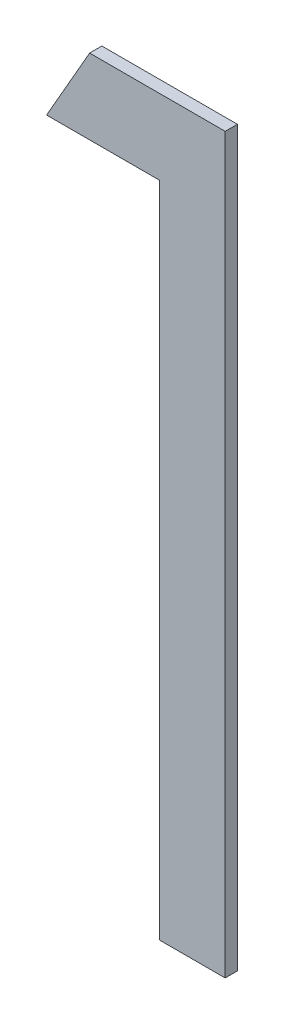
ISO-10303-21;
HEADER;
FILE_DESCRIPTION(('STEP AP214'),'2;1');
FILE_NAME('part.step','',(''),(''),'','','');
FILE_SCHEMA(('AUTOMOTIVE_DESIGN { 1 0 10303 214 1 1 1 1 }'));
ENDSEC;
DATA;
#1=APPLICATION_CONTEXT('core data for automotive mechanical design processes');
#2=APPLICATION_PROTOCOL_DEFINITION('international standard','automotive_design',2000,#1);
#3=PRODUCT_CONTEXT('',#1,'mechanical');
#4=PRODUCT('Part','Part','',(#3));
#5=PRODUCT_RELATED_PRODUCT_CATEGORY('part','',(#4));
#6=PRODUCT_DEFINITION_FORMATION('','',#4);
#7=PRODUCT_DEFINITION_CONTEXT('part definition',#1,'design');
#8=PRODUCT_DEFINITION('design','',#6,#7);
#9=PRODUCT_DEFINITION_SHAPE('','',#8);
#10=(LENGTH_UNIT() NAMED_UNIT(*) SI_UNIT(.MILLI.,.METRE.));
#11=(NAMED_UNIT(*) PLANE_ANGLE_UNIT() SI_UNIT($,.RADIAN.));
#12=(NAMED_UNIT(*) SI_UNIT($,.STERADIAN.) SOLID_ANGLE_UNIT());
#13=UNCERTAINTY_MEASURE_WITH_UNIT(LENGTH_MEASURE(1.E-05),#10,'distance_accuracy_value','');
#14=(GEOMETRIC_REPRESENTATION_CONTEXT(3) GLOBAL_UNCERTAINTY_ASSIGNED_CONTEXT((#13)) GLOBAL_UNIT_ASSIGNED_CONTEXT((#10,
#11,#12)) REPRESENTATION_CONTEXT('',''));
#15=CARTESIAN_POINT('',(0.,0.,0.));
#16=DIRECTION('',(0.,0.,1.));
#17=DIRECTION('',(1.,0.,0.));
#18=AXIS2_PLACEMENT_3D('',#15,#16,#17);
#19=CARTESIAN_POINT('',(0.407517826644609,1.06273011000654,0.551));
#20=DIRECTION('',(-0.867930013859703,0.496686511837693,0.));
#21=DIRECTION('',(-0.496686511837693,-0.867930013859703,0.));
#22=AXIS2_PLACEMENT_3D('',#19,#20,#21);
#23=PLANE('',#22);
#24=DIRECTION('',(0.496686511837698,0.867930013859701,0.));
#25=VECTOR('',#24,1.);
#26=CARTESIAN_POINT('',(0.407517826644609,1.06273011000654,0.55));
#27=LINE('',#26,#25);
#28=CARTESIAN_POINT('',(0.407517826644609,1.06273011000654,0.55));
#29=VERTEX_POINT('',#28);
#30=CARTESIAN_POINT('',(0.411039461259994,1.06888395616039,0.55));
#31=VERTEX_POINT('',#30);
#32=EDGE_CURVE('E11',#29,#31,#27,.T.);
#33=ORIENTED_EDGE('',*,*,#32,.F.);
#34=DIRECTION('',(0.,-2.22044604925006E-13,-1.));
#35=VECTOR('',#34,1.);
#36=CARTESIAN_POINT('',(0.407517826644609,1.06273011000654,0.551));
#37=LINE('',#36,#35);
#38=CARTESIAN_POINT('',(0.407517826644609,1.06273011000654,0.551));
#39=VERTEX_POINT('',#38);
#40=EDGE_CURVE('E119',#39,#29,#37,.T.);
#41=ORIENTED_EDGE('',*,*,#40,.F.);
#42=DIRECTION('',(0.496686511837698,0.867930013859701,0.));
#43=VECTOR('',#42,1.);
#44=CARTESIAN_POINT('',(0.407517826644609,1.06273011000654,0.551));
#45=LINE('',#44,#43);
#46=CARTESIAN_POINT('',(0.411039461259994,1.06888395616039,0.551));
#47=VERTEX_POINT('',#46);
#48=EDGE_CURVE('E112',#39,#47,#45,.T.);
#49=ORIENTED_EDGE('',*,*,#48,.T.);
#50=DIRECTION('',(0.,0.,-1.));
#51=VECTOR('',#50,1.);
#52=CARTESIAN_POINT('',(0.411039461259994,1.06888395616039,0.551));
#53=LINE('',#52,#51);
#54=EDGE_CURVE('E85',#47,#31,#53,.T.);
#55=ORIENTED_EDGE('',*,*,#54,.T.);
#56=EDGE_LOOP('',(#33,#41,#49,#55));
#57=FACE_BOUND('',#56,.T.);
#58=ADVANCED_FACE('F17',(#57),#23,.T.);
#59=CARTESIAN_POINT('',(0.416748595875378,1.06273011000654,0.551));
#60=DIRECTION('',(0.,-1.,0.));
#61=DIRECTION('',(0.,0.,-1.));
#62=AXIS2_PLACEMENT_3D('',#59,#60,#61);
#63=PLANE('',#62);
#64=DIRECTION('',(-1.,0.,0.));
#65=VECTOR('',#64,1.);
#66=CARTESIAN_POINT('',(0.416748595875378,1.06273011000654,0.55));
#67=LINE('',#66,#65);
#68=CARTESIAN_POINT('',(0.416748595875378,1.06273011000654,0.55));
#69=VERTEX_POINT('',#68);
#70=EDGE_CURVE('E24',#69,#29,#67,.T.);
#71=ORIENTED_EDGE('',*,*,#70,.F.);
#72=DIRECTION('',(0.,-2.22044604925006E-13,-1.));
#73=VECTOR('',#72,1.);
#74=CARTESIAN_POINT('',(0.416748595875378,1.06273011000654,0.551));
#75=LINE('',#74,#73);
#76=CARTESIAN_POINT('',(0.416748595875378,1.06273011000654,0.551));
#77=VERTEX_POINT('',#76);
#78=EDGE_CURVE('E114',#77,#69,#75,.T.);
#79=ORIENTED_EDGE('',*,*,#78,.F.);
#80=DIRECTION('',(-1.,0.,0.));
#81=VECTOR('',#80,1.);
#82=CARTESIAN_POINT('',(0.416748595875378,1.06273011000654,0.551));
#83=LINE('',#82,#81);
#84=EDGE_CURVE('E103',#77,#39,#83,.T.);
#85=ORIENTED_EDGE('',*,*,#84,.T.);
#86=ORIENTED_EDGE('',*,*,#40,.T.);
#87=EDGE_LOOP('',(#71,#79,#85,#86));
#88=FACE_BOUND('',#87,.T.);
#89=ADVANCED_FACE('F127',(#88),#63,.T.);
#90=CARTESIAN_POINT('',(0.416748595875378,1.00888395616039,0.551));
#91=DIRECTION('',(-1.,0.,0.));
#92=DIRECTION('',(0.,0.,1.));
#93=AXIS2_PLACEMENT_3D('',#90,#91,#92);
#94=PLANE('',#93);
#95=DIRECTION('',(0.,1.,0.));
#96=VECTOR('',#95,1.);
#97=CARTESIAN_POINT('',(0.416748595875378,1.00888395616039,0.55));
#98=LINE('',#97,#96);
#99=CARTESIAN_POINT('',(0.416748595875378,1.00888395616039,0.55));
#100=VERTEX_POINT('',#99);
#101=EDGE_CURVE('E116',#100,#69,#98,.T.);
#102=ORIENTED_EDGE('',*,*,#101,.F.);
#103=DIRECTION('',(0.,0.,-1.));
#104=VECTOR('',#103,1.);
#105=CARTESIAN_POINT('',(0.416748595875378,1.00888395616039,0.551));
#106=LINE('',#105,#104);
#107=CARTESIAN_POINT('',(0.416748595875378,1.00888395616039,0.551));
#108=VERTEX_POINT('',#107);
#109=EDGE_CURVE('E106',#108,#100,#106,.T.);
#110=ORIENTED_EDGE('',*,*,#109,.F.);
#111=DIRECTION('',(0.,1.,0.));
#112=VECTOR('',#111,1.);
#113=CARTESIAN_POINT('',(0.416748595875378,1.00888395616039,0.551));
#114=LINE('',#113,#112);
#115=EDGE_CURVE('E96',#108,#77,#114,.T.);
#116=ORIENTED_EDGE('',*,*,#115,.T.);
#117=ORIENTED_EDGE('',*,*,#78,.T.);
#118=EDGE_LOOP('',(#102,#110,#116,#117));
#119=FACE_BOUND('',#118,.T.);
#120=ADVANCED_FACE('F123',(#119),#94,.T.);
#121=CARTESIAN_POINT('',(0.422133211259993,1.00888395616039,0.551));
#122=DIRECTION('',(0.,-1.,0.));
#123=DIRECTION('',(0.,0.,-1.));
#124=AXIS2_PLACEMENT_3D('',#121,#122,#123);
#125=PLANE('',#124);
#126=DIRECTION('',(-1.,0.,0.));
#127=VECTOR('',#126,1.);
#128=CARTESIAN_POINT('',(0.422133211259993,1.00888395616039,0.55));
#129=LINE('',#128,#127);
#130=CARTESIAN_POINT('',(0.422133211259993,1.00888395616039,0.55));
#131=VERTEX_POINT('',#130);
#132=EDGE_CURVE('E109',#131,#100,#129,.T.);
#133=ORIENTED_EDGE('',*,*,#132,.F.);
#134=DIRECTION('',(0.,0.,-1.));
#135=VECTOR('',#134,1.);
#136=CARTESIAN_POINT('',(0.422133211259993,1.00888395616039,0.551));
#137=LINE('',#136,#135);
#138=CARTESIAN_POINT('',(0.422133211259993,1.00888395616039,0.551));
#139=VERTEX_POINT('',#138);
#140=EDGE_CURVE('E99',#139,#131,#137,.T.);
#141=ORIENTED_EDGE('',*,*,#140,.F.);
#142=DIRECTION('',(-1.,0.,0.));
#143=VECTOR('',#142,1.);
#144=CARTESIAN_POINT('',(0.422133211259993,1.00888395616039,0.551));
#145=LINE('',#144,#143);
#146=EDGE_CURVE('E79',#139,#108,#145,.T.);
#147=ORIENTED_EDGE('',*,*,#146,.T.);
#148=ORIENTED_EDGE('',*,*,#109,.T.);
#149=EDGE_LOOP('',(#133,#141,#147,#148));
#150=FACE_BOUND('',#149,.T.);
#151=ADVANCED_FACE('F125',(#150),#125,.T.);
#152=CARTESIAN_POINT('',(0.422133211259993,1.06888395616039,0.551));
#153=DIRECTION('',(1.,0.,0.));
#154=DIRECTION('',(0.,0.,-1.));
#155=AXIS2_PLACEMENT_3D('',#152,#153,#154);
#156=PLANE('',#155);
#157=DIRECTION('',(0.,-1.,0.));
#158=VECTOR('',#157,1.);
#159=CARTESIAN_POINT('',(0.422133211259993,1.06888395616039,0.55));
#160=LINE('',#159,#158);
#161=CARTESIAN_POINT('',(0.422133211259993,1.06888395616039,0.55));
#162=VERTEX_POINT('',#161);
#163=EDGE_CURVE('E74',#162,#131,#160,.T.);
#164=ORIENTED_EDGE('',*,*,#163,.F.);
#165=DIRECTION('',(0.,0.,-1.));
#166=VECTOR('',#165,1.);
#167=CARTESIAN_POINT('',(0.422133211259993,1.06888395616039,0.551));
#168=LINE('',#167,#166);
#169=CARTESIAN_POINT('',(0.422133211259993,1.06888395616039,0.551));
#170=VERTEX_POINT('',#169);
#171=EDGE_CURVE('E66',#170,#162,#168,.T.);
#172=ORIENTED_EDGE('',*,*,#171,.F.);
#173=DIRECTION('',(0.,-1.,0.));
#174=VECTOR('',#173,1.);
#175=CARTESIAN_POINT('',(0.422133211259993,1.06888395616039,0.551));
#176=LINE('',#175,#174);
#177=EDGE_CURVE('E71',#170,#139,#176,.T.);
#178=ORIENTED_EDGE('',*,*,#177,.T.);
#179=ORIENTED_EDGE('',*,*,#140,.T.);
#180=EDGE_LOOP('',(#164,#172,#178,#179));
#181=FACE_BOUND('',#180,.T.);
#182=ADVANCED_FACE('F68',(#181),#156,.T.);
#183=CARTESIAN_POINT('',(0.411039461259994,1.06888395616039,0.551));
#184=DIRECTION('',(0.,1.,0.));
#185=DIRECTION('',(0.,0.,1.));
#186=AXIS2_PLACEMENT_3D('',#183,#184,#185);
#187=PLANE('',#186);
#188=DIRECTION('',(1.,0.,0.));
#189=VECTOR('',#188,1.);
#190=CARTESIAN_POINT('',(0.411039461259994,1.06888395616039,0.55));
#191=LINE('',#190,#189);
#192=EDGE_CURVE('E78',#31,#162,#191,.T.);
#193=ORIENTED_EDGE('',*,*,#192,.F.);
#194=ORIENTED_EDGE('',*,*,#54,.F.);
#195=DIRECTION('',(1.,0.,0.));
#196=VECTOR('',#195,1.);
#197=CARTESIAN_POINT('',(0.411039461259994,1.06888395616039,0.551));
#198=LINE('',#197,#196);
#199=EDGE_CURVE('E83',#47,#170,#198,.T.);
#200=ORIENTED_EDGE('',*,*,#199,.T.);
#201=ORIENTED_EDGE('',*,*,#171,.T.);
#202=EDGE_LOOP('',(#193,#194,#200,#201));
#203=FACE_BOUND('',#202,.T.);
#204=ADVANCED_FACE('F84',(#203),#187,.T.);
#205=CARTESIAN_POINT('',(0.,0.,0.551));
#206=DIRECTION('',(0.,0.,-1.));
#207=DIRECTION('',(-1.,0.,0.));
#208=AXIS2_PLACEMENT_3D('',#205,#206,#207);
#209=PLANE('',#208);
#210=ORIENTED_EDGE('',*,*,#48,.F.);
#211=ORIENTED_EDGE('',*,*,#84,.F.);
#212=ORIENTED_EDGE('',*,*,#115,.F.);
#213=ORIENTED_EDGE('',*,*,#146,.F.);
#214=ORIENTED_EDGE('',*,*,#177,.F.);
#215=ORIENTED_EDGE('',*,*,#199,.F.);
#216=EDGE_LOOP('',(#210,#211,#212,#213,#214,#215));
#217=FACE_BOUND('',#216,.T.);
#218=ADVANCED_FACE('F89',(#217),#209,.F.);
#219=CARTESIAN_POINT('',(0.,0.,0.55));
#220=DIRECTION('',(0.,0.,-1.));
#221=DIRECTION('',(-1.,0.,0.));
#222=AXIS2_PLACEMENT_3D('',#219,#220,#221);
#223=PLANE('',#222);
#224=ORIENTED_EDGE('',*,*,#32,.T.);
#225=ORIENTED_EDGE('',*,*,#192,.T.);
#226=ORIENTED_EDGE('',*,*,#163,.T.);
#227=ORIENTED_EDGE('',*,*,#132,.T.);
#228=ORIENTED_EDGE('',*,*,#101,.T.);
#229=ORIENTED_EDGE('',*,*,#70,.T.);
#230=EDGE_LOOP('',(#224,#225,#226,#227,#228,#229));
#231=FACE_BOUND('',#230,.T.);
#232=ADVANCED_FACE('F121',(#231),#223,.T.);
#233=CLOSED_SHELL('',(#58,#89,#120,#151,#182,#204,#218,#232));
#234=MANIFOLD_SOLID_BREP('B1',#233);
#235=ADVANCED_BREP_SHAPE_REPRESENTATION('',(#18,#234),#14);
#236=SHAPE_DEFINITION_REPRESENTATION(#9,#235);
ENDSEC;
END-ISO-10303-21;
